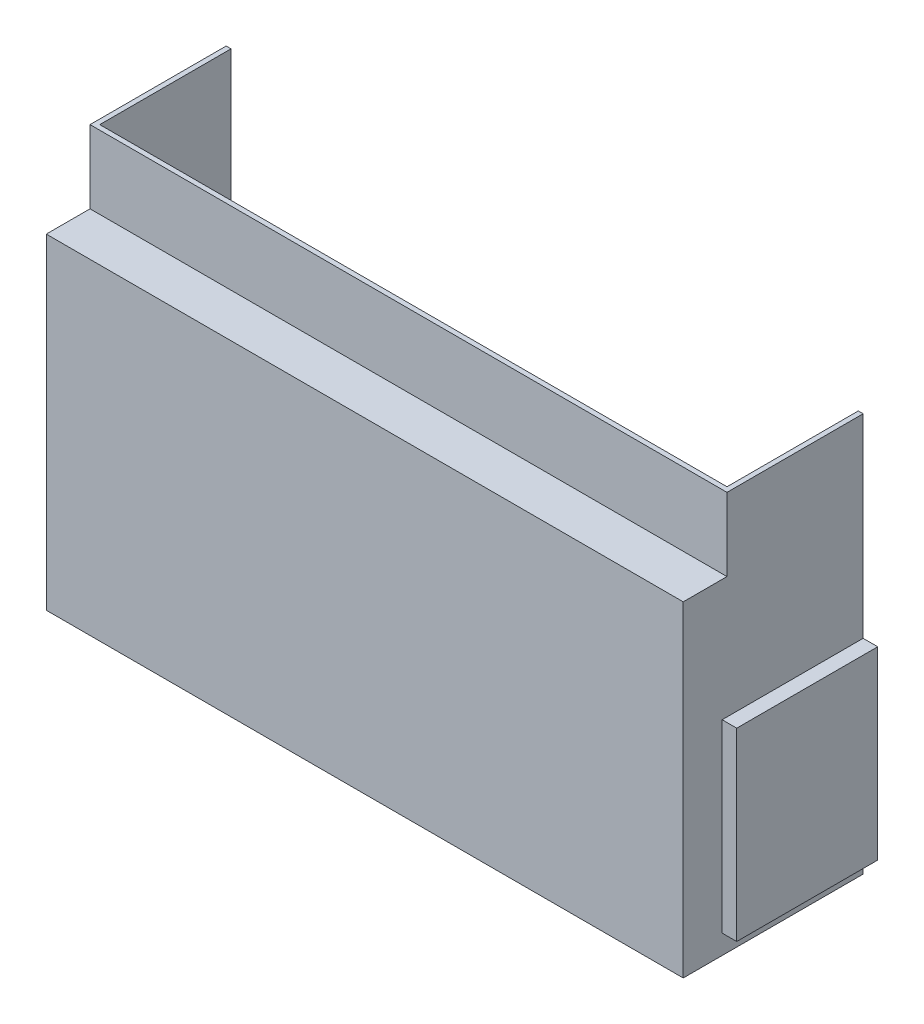
ISO-10303-21;
HEADER;
FILE_DESCRIPTION(('STEP AP214'),'2;1');
FILE_NAME('part.step','',(''),(''),'','','');
FILE_SCHEMA(('AUTOMOTIVE_DESIGN { 1 0 10303 214 1 1 1 1 }'));
ENDSEC;
DATA;
#1=APPLICATION_CONTEXT('core data for automotive mechanical design processes');
#2=APPLICATION_PROTOCOL_DEFINITION('international standard','automotive_design',2000,#1);
#3=PRODUCT_CONTEXT('',#1,'mechanical');
#4=PRODUCT('Part','Part','',(#3));
#5=PRODUCT_RELATED_PRODUCT_CATEGORY('part','',(#4));
#6=PRODUCT_DEFINITION_FORMATION('','',#4);
#7=PRODUCT_DEFINITION_CONTEXT('part definition',#1,'design');
#8=PRODUCT_DEFINITION('design','',#6,#7);
#9=PRODUCT_DEFINITION_SHAPE('','',#8);
#10=(LENGTH_UNIT() NAMED_UNIT(*) SI_UNIT(.MILLI.,.METRE.));
#11=(NAMED_UNIT(*) PLANE_ANGLE_UNIT() SI_UNIT($,.RADIAN.));
#12=(NAMED_UNIT(*) SI_UNIT($,.STERADIAN.) SOLID_ANGLE_UNIT());
#13=UNCERTAINTY_MEASURE_WITH_UNIT(LENGTH_MEASURE(1.E-05),#10,'distance_accuracy_value','');
#14=(GEOMETRIC_REPRESENTATION_CONTEXT(3) GLOBAL_UNCERTAINTY_ASSIGNED_CONTEXT((#13)) GLOBAL_UNIT_ASSIGNED_CONTEXT((#10,
#11,#12)) REPRESENTATION_CONTEXT('',''));
#15=CARTESIAN_POINT('',(0.,0.,0.));
#16=DIRECTION('',(0.,0.,1.));
#17=DIRECTION('',(1.,0.,0.));
#18=AXIS2_PLACEMENT_3D('',#15,#16,#17);
#19=CARTESIAN_POINT('',(0.,0.,101.6));
#20=DIRECTION('',(0.,0.,1.));
#21=DIRECTION('',(1.,0.,0.));
#22=AXIS2_PLACEMENT_3D('',#19,#20,#21);
#23=PLANE('',#22);
#24=DIRECTION('',(0.,1.,0.));
#25=VECTOR('',#24,1.);
#26=CARTESIAN_POINT('',(225.306991150442,106.011283185841,101.6));
#27=LINE('',#26,#25);
#28=CARTESIAN_POINT('',(225.306991150442,-154.338716814159,101.6));
#29=VERTEX_POINT('',#28);
#30=CARTESIAN_POINT('',(225.306991150442,58.3862831858407,101.6));
#31=VERTEX_POINT('',#30);
#32=EDGE_CURVE('E186',#29,#31,#27,.T.);
#33=ORIENTED_EDGE('',*,*,#32,.T.);
#34=DIRECTION('',(-1.,0.,0.));
#35=VECTOR('',#34,1.);
#36=CARTESIAN_POINT('',(0.,58.3862831858407,101.6));
#37=LINE('',#36,#35);
#38=CARTESIAN_POINT('',(-190.618008849558,58.3862831858407,101.6));
#39=VERTEX_POINT('',#38);
#40=EDGE_CURVE('E11',#31,#39,#37,.T.);
#41=ORIENTED_EDGE('',*,*,#40,.T.);
#42=DIRECTION('',(0.,-1.,0.));
#43=VECTOR('',#42,1.);
#44=CARTESIAN_POINT('',(-190.618008849558,106.011283185841,101.6));
#45=LINE('',#44,#43);
#46=CARTESIAN_POINT('',(-190.618008849558,-154.338716814159,101.6));
#47=VERTEX_POINT('',#46);
#48=EDGE_CURVE('E282',#39,#47,#45,.T.);
#49=ORIENTED_EDGE('',*,*,#48,.T.);
#50=DIRECTION('',(1.,0.,0.));
#51=VECTOR('',#50,1.);
#52=CARTESIAN_POINT('',(-187.443008849558,-154.338716814159,101.6));
#53=LINE('',#52,#51);
#54=EDGE_CURVE('E280',#47,#29,#53,.T.);
#55=ORIENTED_EDGE('',*,*,#54,.T.);
#56=EDGE_LOOP('',(#33,#41,#49,#55));
#57=FACE_BOUND('',#56,.T.);
#58=ADVANCED_FACE('F37',(#57),#23,.T.);
#59=CARTESIAN_POINT('',(225.306991150442,106.011283185841,98.425));
#60=DIRECTION('',(-1.,0.,0.));
#61=DIRECTION('',(0.,0.,1.));
#62=AXIS2_PLACEMENT_3D('',#59,#60,#61);
#63=PLANE('',#62);
#64=DIRECTION('',(0.,0.,-1.));
#65=VECTOR('',#64,1.);
#66=CARTESIAN_POINT('',(225.306991150442,106.011283185841,98.425));
#67=LINE('',#66,#65);
#68=CARTESIAN_POINT('',(225.306991150442,106.011283185841,73.025));
#69=VERTEX_POINT('',#68);
#70=CARTESIAN_POINT('',(225.306991150442,106.011283185841,-15.875));
#71=VERTEX_POINT('',#70);
#72=EDGE_CURVE('E185',#69,#71,#67,.T.);
#73=ORIENTED_EDGE('',*,*,#72,.F.);
#74=DIRECTION('',(0.,1.,0.));
#75=VECTOR('',#74,1.);
#76=CARTESIAN_POINT('',(225.306991150442,55.2112831858407,73.025));
#77=LINE('',#76,#75);
#78=CARTESIAN_POINT('',(225.306991150442,58.3862831858407,73.025));
#79=VERTEX_POINT('',#78);
#80=EDGE_CURVE('E286',#79,#69,#77,.T.);
#81=ORIENTED_EDGE('',*,*,#80,.F.);
#82=DIRECTION('',(0.,0.,-1.));
#83=VECTOR('',#82,1.);
#84=CARTESIAN_POINT('',(225.306991150442,58.3862831858407,98.425));
#85=LINE('',#84,#83);
#86=EDGE_CURVE('E83',#31,#79,#85,.T.);
#87=ORIENTED_EDGE('',*,*,#86,.F.);
#88=ORIENTED_EDGE('',*,*,#32,.F.);
#89=DIRECTION('',(0.,0.,-1.));
#90=VECTOR('',#89,1.);
#91=CARTESIAN_POINT('',(225.306991150442,-154.338716814159,98.425));
#92=LINE('',#91,#90);
#93=CARTESIAN_POINT('',(225.306991150442,-154.338716814159,-15.875));
#94=VERTEX_POINT('',#93);
#95=EDGE_CURVE('E290',#29,#94,#92,.T.);
#96=ORIENTED_EDGE('',*,*,#95,.T.);
#97=DIRECTION('',(0.,-1.,0.));
#98=VECTOR('',#97,1.);
#99=CARTESIAN_POINT('',(225.306991150442,-141.638716814159,-15.875));
#100=LINE('',#99,#98);
#101=CARTESIAN_POINT('',(225.306991150442,-141.638716814159,-15.875));
#102=VERTEX_POINT('',#101);
#103=EDGE_CURVE('E239',#102,#94,#100,.T.);
#104=ORIENTED_EDGE('',*,*,#103,.F.);
#105=DIRECTION('',(0.,0.,-1.));
#106=VECTOR('',#105,1.);
#107=CARTESIAN_POINT('',(225.306991150442,-141.638716814159,98.425));
#108=LINE('',#107,#106);
#109=CARTESIAN_POINT('',(225.306991150442,-141.638716814159,76.2));
#110=VERTEX_POINT('',#109);
#111=EDGE_CURVE('E292',#110,#102,#108,.T.);
#112=ORIENTED_EDGE('',*,*,#111,.F.);
#113=DIRECTION('',(0.,-1.,0.));
#114=VECTOR('',#113,1.);
#115=CARTESIAN_POINT('',(225.306991150442,106.011283185841,76.2));
#116=LINE('',#115,#114);
#117=CARTESIAN_POINT('',(225.306991150442,-20.9887168141593,76.2));
#118=VERTEX_POINT('',#117);
#119=EDGE_CURVE('E295',#118,#110,#116,.T.);
#120=ORIENTED_EDGE('',*,*,#119,.F.);
#121=DIRECTION('',(0.,0.,1.));
#122=VECTOR('',#121,1.);
#123=CARTESIAN_POINT('',(225.306991150442,-20.9887168141593,98.425));
#124=LINE('',#123,#122);
#125=CARTESIAN_POINT('',(225.306991150442,-20.9887168141592,-15.875));
#126=VERTEX_POINT('',#125);
#127=EDGE_CURVE('E298',#126,#118,#124,.T.);
#128=ORIENTED_EDGE('',*,*,#127,.F.);
#129=DIRECTION('',(0.,-1.,0.));
#130=VECTOR('',#129,1.);
#131=CARTESIAN_POINT('',(225.306991150442,106.011283185841,-15.875));
#132=LINE('',#131,#130);
#133=EDGE_CURVE('E227',#71,#126,#132,.T.);
#134=ORIENTED_EDGE('',*,*,#133,.F.);
#135=EDGE_LOOP('',(#73,#81,#87,#88,#96,#104,#112,#120,#128,#134));
#136=FACE_BOUND('',#135,.T.);
#137=ADVANCED_FACE('F323',(#136),#63,.F.);
#138=CARTESIAN_POINT('',(-190.618008849558,106.011283185841,98.425));
#139=DIRECTION('',(1.,0.,0.));
#140=DIRECTION('',(0.,1.,0.));
#141=AXIS2_PLACEMENT_3D('',#138,#139,#140);
#142=PLANE('',#141);
#143=DIRECTION('',(0.,0.,1.));
#144=VECTOR('',#143,1.);
#145=CARTESIAN_POINT('',(-190.618008849558,58.3862831858407,98.425));
#146=LINE('',#145,#144);
#147=CARTESIAN_POINT('',(-190.618008849558,58.3862831858407,73.025));
#148=VERTEX_POINT('',#147);
#149=EDGE_CURVE('E56',#148,#39,#146,.T.);
#150=ORIENTED_EDGE('',*,*,#149,.F.);
#151=DIRECTION('',(0.,1.,0.));
#152=VECTOR('',#151,1.);
#153=CARTESIAN_POINT('',(-190.618008849558,106.011283185841,73.025));
#154=LINE('',#153,#152);
#155=CARTESIAN_POINT('',(-190.618008849558,106.011283185841,73.025));
#156=VERTEX_POINT('',#155);
#157=EDGE_CURVE('E183',#148,#156,#154,.T.);
#158=ORIENTED_EDGE('',*,*,#157,.T.);
#159=DIRECTION('',(0.,0.,-1.));
#160=VECTOR('',#159,1.);
#161=CARTESIAN_POINT('',(-190.618008849558,106.011283185841,98.425));
#162=LINE('',#161,#160);
#163=CARTESIAN_POINT('',(-190.618008849558,106.011283185841,-15.875));
#164=VERTEX_POINT('',#163);
#165=EDGE_CURVE('E177',#156,#164,#162,.T.);
#166=ORIENTED_EDGE('',*,*,#165,.T.);
#167=DIRECTION('',(0.,1.,0.));
#168=VECTOR('',#167,1.);
#169=CARTESIAN_POINT('',(-190.618008849558,-154.338716814159,-15.875));
#170=LINE('',#169,#168);
#171=CARTESIAN_POINT('',(-190.618008849558,-154.338716814159,-15.875));
#172=VERTEX_POINT('',#171);
#173=EDGE_CURVE('E182',#172,#164,#170,.T.);
#174=ORIENTED_EDGE('',*,*,#173,.F.);
#175=DIRECTION('',(0.,0.,-1.));
#176=VECTOR('',#175,1.);
#177=CARTESIAN_POINT('',(-190.618008849558,-154.338716814159,98.425));
#178=LINE('',#177,#176);
#179=EDGE_CURVE('E47',#47,#172,#178,.T.);
#180=ORIENTED_EDGE('',*,*,#179,.F.);
#181=ORIENTED_EDGE('',*,*,#48,.F.);
#182=EDGE_LOOP('',(#150,#158,#166,#174,#180,#181));
#183=FACE_BOUND('',#182,.T.);
#184=ADVANCED_FACE('F179',(#183),#142,.F.);
#185=CARTESIAN_POINT('',(-187.443008849558,-154.338716814159,98.425));
#186=DIRECTION('',(0.,1.,0.));
#187=DIRECTION('',(0.,0.,1.));
#188=AXIS2_PLACEMENT_3D('',#185,#186,#187);
#189=PLANE('',#188);
#190=ORIENTED_EDGE('',*,*,#179,.T.);
#191=DIRECTION('',(-1.,0.,0.));
#192=VECTOR('',#191,1.);
#193=CARTESIAN_POINT('',(225.306991150442,-154.338716814159,-15.875));
#194=LINE('',#193,#192);
#195=EDGE_CURVE('E202',#94,#172,#194,.T.);
#196=ORIENTED_EDGE('',*,*,#195,.F.);
#197=ORIENTED_EDGE('',*,*,#95,.F.);
#198=ORIENTED_EDGE('',*,*,#54,.F.);
#199=EDGE_LOOP('',(#190,#196,#197,#198));
#200=FACE_BOUND('',#199,.T.);
#201=ADVANCED_FACE('F343',(#200),#189,.F.);
#202=CARTESIAN_POINT('',(-187.443008849558,106.011283185841,98.425));
#203=DIRECTION('',(0.,-1.,0.));
#204=DIRECTION('',(0.,0.,-1.));
#205=AXIS2_PLACEMENT_3D('',#202,#203,#204);
#206=PLANE('',#205);
#207=DIRECTION('',(-1.,0.,0.));
#208=VECTOR('',#207,1.);
#209=CARTESIAN_POINT('',(-187.443008849558,106.011283185841,69.85));
#210=LINE('',#209,#208);
#211=CARTESIAN_POINT('',(222.131991150442,106.011283185841,69.85));
#212=VERTEX_POINT('',#211);
#213=CARTESIAN_POINT('',(-187.443008849558,106.011283185841,69.85));
#214=VERTEX_POINT('',#213);
#215=EDGE_CURVE('E242',#212,#214,#210,.T.);
#216=ORIENTED_EDGE('',*,*,#215,.T.);
#217=DIRECTION('',(0.,0.,-1.));
#218=VECTOR('',#217,1.);
#219=CARTESIAN_POINT('',(-187.443008849558,106.011283185841,98.425));
#220=LINE('',#219,#218);
#221=CARTESIAN_POINT('',(-187.443008849558,106.011283185841,-15.875));
#222=VERTEX_POINT('',#221);
#223=EDGE_CURVE('E192',#214,#222,#220,.T.);
#224=ORIENTED_EDGE('',*,*,#223,.T.);
#225=DIRECTION('',(1.,0.,0.));
#226=VECTOR('',#225,1.);
#227=CARTESIAN_POINT('',(-190.618008849558,106.011283185841,-15.875));
#228=LINE('',#227,#226);
#229=EDGE_CURVE('E188',#164,#222,#228,.T.);
#230=ORIENTED_EDGE('',*,*,#229,.F.);
#231=ORIENTED_EDGE('',*,*,#165,.F.);
#232=DIRECTION('',(-1.,0.,0.));
#233=VECTOR('',#232,1.);
#234=CARTESIAN_POINT('',(-187.443008849558,106.011283185841,73.025));
#235=LINE('',#234,#233);
#236=EDGE_CURVE('E41',#69,#156,#235,.T.);
#237=ORIENTED_EDGE('',*,*,#236,.F.);
#238=ORIENTED_EDGE('',*,*,#72,.T.);
#239=DIRECTION('',(1.,0.,0.));
#240=VECTOR('',#239,1.);
#241=CARTESIAN_POINT('',(222.131991150442,106.011283185841,-15.875));
#242=LINE('',#241,#240);
#243=CARTESIAN_POINT('',(222.131991150442,106.011283185841,-15.875));
#244=VERTEX_POINT('',#243);
#245=EDGE_CURVE('E224',#244,#71,#242,.T.);
#246=ORIENTED_EDGE('',*,*,#245,.F.);
#247=DIRECTION('',(0.,0.,-1.));
#248=VECTOR('',#247,1.);
#249=CARTESIAN_POINT('',(222.131991150442,106.011283185841,98.425));
#250=LINE('',#249,#248);
#251=EDGE_CURVE('E614',#212,#244,#250,.T.);
#252=ORIENTED_EDGE('',*,*,#251,.F.);
#253=EDGE_LOOP('',(#216,#224,#230,#231,#237,#238,#246,#252));
#254=FACE_BOUND('',#253,.T.);
#255=ADVANCED_FACE('F190',(#254),#206,.F.);
#256=CARTESIAN_POINT('',(231.656991150442,-20.9887168141592,0.));
#257=DIRECTION('',(0.,-1.,0.));
#258=DIRECTION('',(1.,0.,0.));
#259=AXIS2_PLACEMENT_3D('',#256,#257,#258);
#260=PLANE('',#259);
#261=ORIENTED_EDGE('',*,*,#127,.T.);
#262=DIRECTION('',(-1.,0.,0.));
#263=VECTOR('',#262,1.);
#264=CARTESIAN_POINT('',(231.656991150442,-20.9887168141593,76.2));
#265=LINE('',#264,#263);
#266=CARTESIAN_POINT('',(234.831991150442,-20.9887168141593,76.2));
#267=VERTEX_POINT('',#266);
#268=EDGE_CURVE('E284',#267,#118,#265,.T.);
#269=ORIENTED_EDGE('',*,*,#268,.F.);
#270=DIRECTION('',(0.,0.,1.));
#271=VECTOR('',#270,1.);
#272=CARTESIAN_POINT('',(234.831991150442,-20.9887168141592,0.));
#273=LINE('',#272,#271);
#274=CARTESIAN_POINT('',(234.831991150442,-20.9887168141592,-15.875));
#275=VERTEX_POINT('',#274);
#276=EDGE_CURVE('E294',#275,#267,#273,.T.);
#277=ORIENTED_EDGE('',*,*,#276,.F.);
#278=DIRECTION('',(1.,0.,0.));
#279=VECTOR('',#278,1.);
#280=CARTESIAN_POINT('',(225.306991150442,-20.9887168141592,-15.875));
#281=LINE('',#280,#279);
#282=EDGE_CURVE('E230',#126,#275,#281,.T.);
#283=ORIENTED_EDGE('',*,*,#282,.F.);
#284=EDGE_LOOP('',(#261,#269,#277,#283));
#285=FACE_BOUND('',#284,.T.);
#286=ADVANCED_FACE('F327',(#285),#260,.F.);
#287=CARTESIAN_POINT('',(231.656991150442,-138.463716814159,76.2));
#288=DIRECTION('',(0.,0.,-1.));
#289=DIRECTION('',(0.,1.,0.));
#290=AXIS2_PLACEMENT_3D('',#287,#288,#289);
#291=PLANE('',#290);
#292=ORIENTED_EDGE('',*,*,#119,.T.);
#293=DIRECTION('',(-1.,0.,0.));
#294=VECTOR('',#293,1.);
#295=CARTESIAN_POINT('',(231.656991150442,-141.638716814159,76.2));
#296=LINE('',#295,#294);
#297=CARTESIAN_POINT('',(234.831991150442,-141.638716814159,76.2));
#298=VERTEX_POINT('',#297);
#299=EDGE_CURVE('E307',#298,#110,#296,.T.);
#300=ORIENTED_EDGE('',*,*,#299,.F.);
#301=DIRECTION('',(0.,-1.,0.));
#302=VECTOR('',#301,1.);
#303=CARTESIAN_POINT('',(234.831991150442,-138.463716814159,76.2));
#304=LINE('',#303,#302);
#305=EDGE_CURVE('E309',#267,#298,#304,.T.);
#306=ORIENTED_EDGE('',*,*,#305,.F.);
#307=ORIENTED_EDGE('',*,*,#268,.T.);
#308=EDGE_LOOP('',(#292,#300,#306,#307));
#309=FACE_BOUND('',#308,.T.);
#310=ADVANCED_FACE('F330',(#309),#291,.F.);
#311=CARTESIAN_POINT('',(231.656991150442,-141.638716814159,0.));
#312=DIRECTION('',(0.,1.,0.));
#313=DIRECTION('',(-1.,0.,0.));
#314=AXIS2_PLACEMENT_3D('',#311,#312,#313);
#315=PLANE('',#314);
#316=ORIENTED_EDGE('',*,*,#111,.T.);
#317=DIRECTION('',(-1.,0.,0.));
#318=VECTOR('',#317,1.);
#319=CARTESIAN_POINT('',(234.831991150442,-141.638716814159,-15.875));
#320=LINE('',#319,#318);
#321=CARTESIAN_POINT('',(234.831991150442,-141.638716814159,-15.875));
#322=VERTEX_POINT('',#321);
#323=EDGE_CURVE('E236',#322,#102,#320,.T.);
#324=ORIENTED_EDGE('',*,*,#323,.F.);
#325=DIRECTION('',(0.,0.,-1.));
#326=VECTOR('',#325,1.);
#327=CARTESIAN_POINT('',(234.831991150442,-141.638716814159,0.));
#328=LINE('',#327,#326);
#329=EDGE_CURVE('E312',#298,#322,#328,.T.);
#330=ORIENTED_EDGE('',*,*,#329,.F.);
#331=ORIENTED_EDGE('',*,*,#299,.T.);
#332=EDGE_LOOP('',(#316,#324,#330,#331));
#333=FACE_BOUND('',#332,.T.);
#334=ADVANCED_FACE('F339',(#333),#315,.F.);
#335=CARTESIAN_POINT('',(234.831991150442,0.,0.));
#336=DIRECTION('',(1.,0.,0.));
#337=DIRECTION('',(0.,1.,0.));
#338=AXIS2_PLACEMENT_3D('',#335,#336,#337);
#339=PLANE('',#338);
#340=ORIENTED_EDGE('',*,*,#329,.T.);
#341=DIRECTION('',(0.,-1.,0.));
#342=VECTOR('',#341,1.);
#343=CARTESIAN_POINT('',(234.831991150442,-20.9887168141592,-15.875));
#344=LINE('',#343,#342);
#345=EDGE_CURVE('E233',#275,#322,#344,.T.);
#346=ORIENTED_EDGE('',*,*,#345,.F.);
#347=ORIENTED_EDGE('',*,*,#276,.T.);
#348=ORIENTED_EDGE('',*,*,#305,.T.);
#349=EDGE_LOOP('',(#340,#346,#347,#348));
#350=FACE_BOUND('',#349,.T.);
#351=ADVANCED_FACE('F334',(#350),#339,.T.);
#352=CARTESIAN_POINT('',(-187.443008849558,55.2112831858407,73.025));
#353=DIRECTION('',(0.,0.,-1.));
#354=DIRECTION('',(-1.,0.,0.));
#355=AXIS2_PLACEMENT_3D('',#352,#353,#354);
#356=PLANE('',#355);
#357=DIRECTION('',(-1.,0.,0.));
#358=VECTOR('',#357,1.);
#359=CARTESIAN_POINT('',(0.,58.3862831858407,73.025));
#360=LINE('',#359,#358);
#361=EDGE_CURVE('E288',#79,#148,#360,.T.);
#362=ORIENTED_EDGE('',*,*,#361,.F.);
#363=ORIENTED_EDGE('',*,*,#80,.T.);
#364=ORIENTED_EDGE('',*,*,#236,.T.);
#365=ORIENTED_EDGE('',*,*,#157,.F.);
#366=EDGE_LOOP('',(#362,#363,#364,#365));
#367=FACE_BOUND('',#366,.T.);
#368=ADVANCED_FACE('F347',(#367),#356,.F.);
#369=CARTESIAN_POINT('',(0.,58.3862831858407,0.));
#370=DIRECTION('',(0.,1.,0.));
#371=DIRECTION('',(0.,0.,1.));
#372=AXIS2_PLACEMENT_3D('',#369,#370,#371);
#373=PLANE('',#372);
#374=ORIENTED_EDGE('',*,*,#86,.T.);
#375=ORIENTED_EDGE('',*,*,#361,.T.);
#376=ORIENTED_EDGE('',*,*,#149,.T.);
#377=ORIENTED_EDGE('',*,*,#40,.F.);
#378=EDGE_LOOP('',(#374,#375,#376,#377));
#379=FACE_BOUND('',#378,.T.);
#380=ADVANCED_FACE('F39',(#379),#373,.T.);
#381=CARTESIAN_POINT('',(0.,0.,98.425));
#382=DIRECTION('',(0.,0.,1.));
#383=DIRECTION('',(1.,0.,0.));
#384=AXIS2_PLACEMENT_3D('',#381,#382,#383);
#385=PLANE('',#384);
#386=DIRECTION('',(0.,1.,0.));
#387=VECTOR('',#386,1.);
#388=CARTESIAN_POINT('',(222.131991150442,106.011283185841,98.425));
#389=LINE('',#388,#387);
#390=CARTESIAN_POINT('',(222.131991150442,-151.163716814159,98.425));
#391=VERTEX_POINT('',#390);
#392=CARTESIAN_POINT('',(222.131991150442,55.2112831858407,98.425));
#393=VERTEX_POINT('',#392);
#394=EDGE_CURVE('E607',#391,#393,#389,.T.);
#395=ORIENTED_EDGE('',*,*,#394,.F.);
#396=DIRECTION('',(1.,0.,0.));
#397=VECTOR('',#396,1.);
#398=CARTESIAN_POINT('',(-187.443008849558,-151.163716814159,98.425));
#399=LINE('',#398,#397);
#400=CARTESIAN_POINT('',(-187.443008849558,-151.163716814159,98.425));
#401=VERTEX_POINT('',#400);
#402=EDGE_CURVE('E609',#401,#391,#399,.T.);
#403=ORIENTED_EDGE('',*,*,#402,.F.);
#404=DIRECTION('',(0.,-1.,0.));
#405=VECTOR('',#404,1.);
#406=CARTESIAN_POINT('',(-187.443008849558,106.011283185841,98.425));
#407=LINE('',#406,#405);
#408=CARTESIAN_POINT('',(-187.443008849558,55.2112831858407,98.425));
#409=VERTEX_POINT('',#408);
#410=EDGE_CURVE('E616',#409,#401,#407,.T.);
#411=ORIENTED_EDGE('',*,*,#410,.F.);
#412=DIRECTION('',(-1.,0.,0.));
#413=VECTOR('',#412,1.);
#414=CARTESIAN_POINT('',(0.,55.2112831858407,98.425));
#415=LINE('',#414,#413);
#416=EDGE_CURVE('E275',#393,#409,#415,.T.);
#417=ORIENTED_EDGE('',*,*,#416,.F.);
#418=EDGE_LOOP('',(#395,#403,#411,#417));
#419=FACE_BOUND('',#418,.T.);
#420=ADVANCED_FACE('F353',(#419),#385,.F.);
#421=CARTESIAN_POINT('',(222.131991150442,106.011283185841,98.425));
#422=DIRECTION('',(-1.,0.,0.));
#423=DIRECTION('',(0.,0.,1.));
#424=AXIS2_PLACEMENT_3D('',#421,#422,#423);
#425=PLANE('',#424);
#426=ORIENTED_EDGE('',*,*,#251,.T.);
#427=DIRECTION('',(0.,1.,0.));
#428=VECTOR('',#427,1.);
#429=CARTESIAN_POINT('',(222.131991150442,-24.1637168141592,-15.875));
#430=LINE('',#429,#428);
#431=CARTESIAN_POINT('',(222.131991150442,-24.1637168141592,-15.875));
#432=VERTEX_POINT('',#431);
#433=EDGE_CURVE('E221',#432,#244,#430,.T.);
#434=ORIENTED_EDGE('',*,*,#433,.F.);
#435=DIRECTION('',(0.,0.,1.));
#436=VECTOR('',#435,1.);
#437=CARTESIAN_POINT('',(222.131991150442,-24.1637168141592,0.));
#438=LINE('',#437,#436);
#439=CARTESIAN_POINT('',(222.131991150442,-24.1637168141593,73.025));
#440=VERTEX_POINT('',#439);
#441=EDGE_CURVE('E255',#432,#440,#438,.T.);
#442=ORIENTED_EDGE('',*,*,#441,.T.);
#443=DIRECTION('',(0.,-1.,0.));
#444=VECTOR('',#443,1.);
#445=CARTESIAN_POINT('',(222.131991150442,-138.463716814159,73.025));
#446=LINE('',#445,#444);
#447=CARTESIAN_POINT('',(222.131991150442,-138.463716814159,73.025));
#448=VERTEX_POINT('',#447);
#449=EDGE_CURVE('E264',#440,#448,#446,.T.);
#450=ORIENTED_EDGE('',*,*,#449,.T.);
#451=DIRECTION('',(0.,0.,-1.));
#452=VECTOR('',#451,1.);
#453=CARTESIAN_POINT('',(222.131991150442,-138.463716814159,0.));
#454=LINE('',#453,#452);
#455=CARTESIAN_POINT('',(222.131991150442,-138.463716814159,-15.875));
#456=VERTEX_POINT('',#455);
#457=EDGE_CURVE('E259',#448,#456,#454,.T.);
#458=ORIENTED_EDGE('',*,*,#457,.T.);
#459=DIRECTION('',(0.,1.,0.));
#460=VECTOR('',#459,1.);
#461=CARTESIAN_POINT('',(222.131991150442,-151.163716814159,-15.875));
#462=LINE('',#461,#460);
#463=CARTESIAN_POINT('',(222.131991150442,-151.163716814159,-15.875));
#464=VERTEX_POINT('',#463);
#465=EDGE_CURVE('E209',#464,#456,#462,.T.);
#466=ORIENTED_EDGE('',*,*,#465,.F.);
#467=DIRECTION('',(0.,0.,-1.));
#468=VECTOR('',#467,1.);
#469=CARTESIAN_POINT('',(222.131991150442,-151.163716814159,98.425));
#470=LINE('',#469,#468);
#471=EDGE_CURVE('E621',#391,#464,#470,.T.);
#472=ORIENTED_EDGE('',*,*,#471,.F.);
#473=ORIENTED_EDGE('',*,*,#394,.T.);
#474=DIRECTION('',(0.,0.,-1.));
#475=VECTOR('',#474,1.);
#476=CARTESIAN_POINT('',(222.131991150442,55.2112831858407,98.425));
#477=LINE('',#476,#475);
#478=CARTESIAN_POINT('',(222.131991150442,55.2112831858407,69.85));
#479=VERTEX_POINT('',#478);
#480=EDGE_CURVE('E251',#393,#479,#477,.T.);
#481=ORIENTED_EDGE('',*,*,#480,.T.);
#482=DIRECTION('',(0.,1.,0.));
#483=VECTOR('',#482,1.);
#484=CARTESIAN_POINT('',(222.131991150442,55.2112831858407,69.85));
#485=LINE('',#484,#483);
#486=EDGE_CURVE('E246',#479,#212,#485,.T.);
#487=ORIENTED_EDGE('',*,*,#486,.T.);
#488=EDGE_LOOP('',(#426,#434,#442,#450,#458,#466,#472,#473,#481,#487));
#489=FACE_BOUND('',#488,.T.);
#490=ADVANCED_FACE('F389',(#489),#425,.T.);
#491=CARTESIAN_POINT('',(-187.443008849558,106.011283185841,98.425));
#492=DIRECTION('',(1.,0.,0.));
#493=DIRECTION('',(0.,1.,0.));
#494=AXIS2_PLACEMENT_3D('',#491,#492,#493);
#495=PLANE('',#494);
#496=DIRECTION('',(0.,0.,1.));
#497=VECTOR('',#496,1.);
#498=CARTESIAN_POINT('',(-187.443008849558,55.2112831858407,98.425));
#499=LINE('',#498,#497);
#500=CARTESIAN_POINT('',(-187.443008849558,55.2112831858407,69.85));
#501=VERTEX_POINT('',#500);
#502=EDGE_CURVE('E249',#501,#409,#499,.T.);
#503=ORIENTED_EDGE('',*,*,#502,.T.);
#504=ORIENTED_EDGE('',*,*,#410,.T.);
#505=DIRECTION('',(0.,0.,-1.));
#506=VECTOR('',#505,1.);
#507=CARTESIAN_POINT('',(-187.443008849558,-151.163716814159,98.425));
#508=LINE('',#507,#506);
#509=CARTESIAN_POINT('',(-187.443008849558,-151.163716814159,-15.875));
#510=VERTEX_POINT('',#509);
#511=EDGE_CURVE('E278',#401,#510,#508,.T.);
#512=ORIENTED_EDGE('',*,*,#511,.T.);
#513=DIRECTION('',(0.,-1.,0.));
#514=VECTOR('',#513,1.);
#515=CARTESIAN_POINT('',(-187.443008849558,106.011283185841,-15.875));
#516=LINE('',#515,#514);
#517=EDGE_CURVE('E196',#222,#510,#516,.T.);
#518=ORIENTED_EDGE('',*,*,#517,.F.);
#519=ORIENTED_EDGE('',*,*,#223,.F.);
#520=DIRECTION('',(0.,1.,0.));
#521=VECTOR('',#520,1.);
#522=CARTESIAN_POINT('',(-187.443008849558,106.011283185841,69.85));
#523=LINE('',#522,#521);
#524=EDGE_CURVE('E253',#501,#214,#523,.T.);
#525=ORIENTED_EDGE('',*,*,#524,.F.);
#526=EDGE_LOOP('',(#503,#504,#512,#518,#519,#525));
#527=FACE_BOUND('',#526,.T.);
#528=ADVANCED_FACE('F394',(#527),#495,.T.);
#529=CARTESIAN_POINT('',(-187.443008849558,-151.163716814159,98.425));
#530=DIRECTION('',(0.,1.,0.));
#531=DIRECTION('',(0.,0.,1.));
#532=AXIS2_PLACEMENT_3D('',#529,#530,#531);
#533=PLANE('',#532);
#534=ORIENTED_EDGE('',*,*,#471,.T.);
#535=DIRECTION('',(1.,0.,0.));
#536=VECTOR('',#535,1.);
#537=CARTESIAN_POINT('',(-187.443008849558,-151.163716814159,-15.875));
#538=LINE('',#537,#536);
#539=EDGE_CURVE('E206',#510,#464,#538,.T.);
#540=ORIENTED_EDGE('',*,*,#539,.F.);
#541=ORIENTED_EDGE('',*,*,#511,.F.);
#542=ORIENTED_EDGE('',*,*,#402,.T.);
#543=EDGE_LOOP('',(#534,#540,#541,#542));
#544=FACE_BOUND('',#543,.T.);
#545=ADVANCED_FACE('F405',(#544),#533,.T.);
#546=CARTESIAN_POINT('',(231.656991150442,-24.1637168141592,0.));
#547=DIRECTION('',(0.,-1.,0.));
#548=DIRECTION('',(1.,0.,0.));
#549=AXIS2_PLACEMENT_3D('',#546,#547,#548);
#550=PLANE('',#549);
#551=ORIENTED_EDGE('',*,*,#441,.F.);
#552=DIRECTION('',(-1.,0.,0.));
#553=VECTOR('',#552,1.);
#554=CARTESIAN_POINT('',(231.656991150442,-24.1637168141592,-15.875));
#555=LINE('',#554,#553);
#556=CARTESIAN_POINT('',(231.656991150442,-24.1637168141592,-15.875));
#557=VERTEX_POINT('',#556);
#558=EDGE_CURVE('E218',#557,#432,#555,.T.);
#559=ORIENTED_EDGE('',*,*,#558,.F.);
#560=DIRECTION('',(0.,0.,1.));
#561=VECTOR('',#560,1.);
#562=CARTESIAN_POINT('',(231.656991150442,-24.1637168141592,0.));
#563=LINE('',#562,#561);
#564=CARTESIAN_POINT('',(231.656991150442,-24.1637168141593,73.025));
#565=VERTEX_POINT('',#564);
#566=EDGE_CURVE('E256',#557,#565,#563,.T.);
#567=ORIENTED_EDGE('',*,*,#566,.T.);
#568=DIRECTION('',(-1.,0.,0.));
#569=VECTOR('',#568,1.);
#570=CARTESIAN_POINT('',(231.656991150442,-24.1637168141593,73.025));
#571=LINE('',#570,#569);
#572=EDGE_CURVE('E628',#565,#440,#571,.T.);
#573=ORIENTED_EDGE('',*,*,#572,.T.);
#574=EDGE_LOOP('',(#551,#559,#567,#573));
#575=FACE_BOUND('',#574,.T.);
#576=ADVANCED_FACE('F415',(#575),#550,.T.);
#577=CARTESIAN_POINT('',(231.656991150442,-138.463716814159,73.025));
#578=DIRECTION('',(0.,0.,-1.));
#579=DIRECTION('',(0.,1.,0.));
#580=AXIS2_PLACEMENT_3D('',#577,#578,#579);
#581=PLANE('',#580);
#582=ORIENTED_EDGE('',*,*,#449,.F.);
#583=ORIENTED_EDGE('',*,*,#572,.F.);
#584=DIRECTION('',(0.,-1.,0.));
#585=VECTOR('',#584,1.);
#586=CARTESIAN_POINT('',(231.656991150442,-138.463716814159,73.025));
#587=LINE('',#586,#585);
#588=CARTESIAN_POINT('',(231.656991150442,-138.463716814159,73.025));
#589=VERTEX_POINT('',#588);
#590=EDGE_CURVE('E258',#565,#589,#587,.T.);
#591=ORIENTED_EDGE('',*,*,#590,.T.);
#592=DIRECTION('',(-1.,0.,0.));
#593=VECTOR('',#592,1.);
#594=CARTESIAN_POINT('',(231.656991150442,-138.463716814159,73.025));
#595=LINE('',#594,#593);
#596=EDGE_CURVE('E263',#589,#448,#595,.T.);
#597=ORIENTED_EDGE('',*,*,#596,.T.);
#598=EDGE_LOOP('',(#582,#583,#591,#597));
#599=FACE_BOUND('',#598,.T.);
#600=ADVANCED_FACE('F426',(#599),#581,.T.);
#601=CARTESIAN_POINT('',(231.656991150442,-138.463716814159,0.));
#602=DIRECTION('',(0.,1.,0.));
#603=DIRECTION('',(-1.,0.,0.));
#604=AXIS2_PLACEMENT_3D('',#601,#602,#603);
#605=PLANE('',#604);
#606=ORIENTED_EDGE('',*,*,#457,.F.);
#607=ORIENTED_EDGE('',*,*,#596,.F.);
#608=DIRECTION('',(0.,0.,-1.));
#609=VECTOR('',#608,1.);
#610=CARTESIAN_POINT('',(231.656991150442,-138.463716814159,0.));
#611=LINE('',#610,#609);
#612=CARTESIAN_POINT('',(231.656991150442,-138.463716814159,-15.875));
#613=VERTEX_POINT('',#612);
#614=EDGE_CURVE('E261',#589,#613,#611,.T.);
#615=ORIENTED_EDGE('',*,*,#614,.T.);
#616=DIRECTION('',(1.,0.,0.));
#617=VECTOR('',#616,1.);
#618=CARTESIAN_POINT('',(222.131991150442,-138.463716814159,-15.875));
#619=LINE('',#618,#617);
#620=EDGE_CURVE('E212',#456,#613,#619,.T.);
#621=ORIENTED_EDGE('',*,*,#620,.F.);
#622=EDGE_LOOP('',(#606,#607,#615,#621));
#623=FACE_BOUND('',#622,.T.);
#624=ADVANCED_FACE('F435',(#623),#605,.T.);
#625=CARTESIAN_POINT('',(231.656991150442,0.,0.));
#626=DIRECTION('',(1.,0.,0.));
#627=DIRECTION('',(0.,1.,0.));
#628=AXIS2_PLACEMENT_3D('',#625,#626,#627);
#629=PLANE('',#628);
#630=ORIENTED_EDGE('',*,*,#566,.F.);
#631=DIRECTION('',(0.,1.,0.));
#632=VECTOR('',#631,1.);
#633=CARTESIAN_POINT('',(231.656991150442,-138.463716814159,-15.875));
#634=LINE('',#633,#632);
#635=EDGE_CURVE('E215',#613,#557,#634,.T.);
#636=ORIENTED_EDGE('',*,*,#635,.F.);
#637=ORIENTED_EDGE('',*,*,#614,.F.);
#638=ORIENTED_EDGE('',*,*,#590,.F.);
#639=EDGE_LOOP('',(#630,#636,#637,#638));
#640=FACE_BOUND('',#639,.T.);
#641=ADVANCED_FACE('F439',(#640),#629,.F.);
#642=CARTESIAN_POINT('',(-187.443008849558,55.2112831858407,69.85));
#643=DIRECTION('',(0.,0.,-1.));
#644=DIRECTION('',(-1.,0.,0.));
#645=AXIS2_PLACEMENT_3D('',#642,#643,#644);
#646=PLANE('',#645);
#647=DIRECTION('',(-1.,0.,0.));
#648=VECTOR('',#647,1.);
#649=CARTESIAN_POINT('',(-256.510061581423,55.2112831858407,69.85));
#650=LINE('',#649,#648);
#651=EDGE_CURVE('E243',#479,#501,#650,.T.);
#652=ORIENTED_EDGE('',*,*,#651,.T.);
#653=ORIENTED_EDGE('',*,*,#524,.T.);
#654=ORIENTED_EDGE('',*,*,#215,.F.);
#655=ORIENTED_EDGE('',*,*,#486,.F.);
#656=EDGE_LOOP('',(#652,#653,#654,#655));
#657=FACE_BOUND('',#656,.T.);
#658=ADVANCED_FACE('F450',(#657),#646,.T.);
#659=CARTESIAN_POINT('',(0.,55.2112831858407,0.));
#660=DIRECTION('',(0.,1.,0.));
#661=DIRECTION('',(0.,0.,1.));
#662=AXIS2_PLACEMENT_3D('',#659,#660,#661);
#663=PLANE('',#662);
#664=ORIENTED_EDGE('',*,*,#480,.F.);
#665=ORIENTED_EDGE('',*,*,#416,.T.);
#666=ORIENTED_EDGE('',*,*,#502,.F.);
#667=ORIENTED_EDGE('',*,*,#651,.F.);
#668=EDGE_LOOP('',(#664,#665,#666,#667));
#669=FACE_BOUND('',#668,.T.);
#670=ADVANCED_FACE('F461',(#669),#663,.F.);
#671=CARTESIAN_POINT('',(0.,0.,-15.875));
#672=DIRECTION('',(0.,0.,-1.));
#673=DIRECTION('',(-1.,0.,0.));
#674=AXIS2_PLACEMENT_3D('',#671,#672,#673);
#675=PLANE('',#674);
#676=ORIENTED_EDGE('',*,*,#173,.T.);
#677=ORIENTED_EDGE('',*,*,#229,.T.);
#678=ORIENTED_EDGE('',*,*,#517,.T.);
#679=ORIENTED_EDGE('',*,*,#539,.T.);
#680=ORIENTED_EDGE('',*,*,#465,.T.);
#681=ORIENTED_EDGE('',*,*,#620,.T.);
#682=ORIENTED_EDGE('',*,*,#635,.T.);
#683=ORIENTED_EDGE('',*,*,#558,.T.);
#684=ORIENTED_EDGE('',*,*,#433,.T.);
#685=ORIENTED_EDGE('',*,*,#245,.T.);
#686=ORIENTED_EDGE('',*,*,#133,.T.);
#687=ORIENTED_EDGE('',*,*,#282,.T.);
#688=ORIENTED_EDGE('',*,*,#345,.T.);
#689=ORIENTED_EDGE('',*,*,#323,.T.);
#690=ORIENTED_EDGE('',*,*,#103,.T.);
#691=ORIENTED_EDGE('',*,*,#195,.T.);
#692=EDGE_LOOP('',(#676,#677,#678,#679,#680,#681,#682,#683,#684,#685,#686,#687,#688,#689,#690,#691));
#693=FACE_BOUND('',#692,.T.);
#694=ADVANCED_FACE('F199',(#693),#675,.T.);
#695=CLOSED_SHELL('',(#58,#137,#184,#201,#255,#286,#310,#334,#351,#368,#380,#420,#490,#528,#545,
#576,#600,#624,#641,#658,#670,#694));
#696=MANIFOLD_SOLID_BREP('B2',#695);
#697=ADVANCED_BREP_SHAPE_REPRESENTATION('',(#18,#696),#14);
#698=SHAPE_DEFINITION_REPRESENTATION(#9,#697);
ENDSEC;
END-ISO-10303-21;
